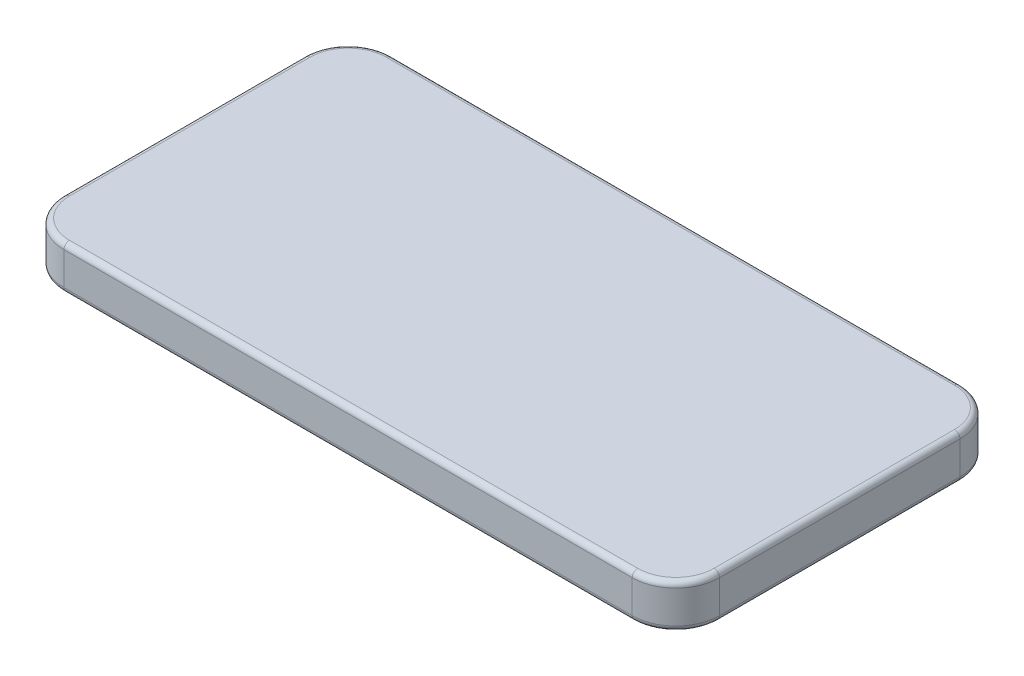
ISO-10303-21;
HEADER;
FILE_DESCRIPTION(('STEP AP214'),'2;1');
FILE_NAME('part.step','',(''),(''),'','','');
FILE_SCHEMA(('AUTOMOTIVE_DESIGN { 1 0 10303 214 1 1 1 1 }'));
ENDSEC;
DATA;
#1=APPLICATION_CONTEXT('core data for automotive mechanical design processes');
#2=APPLICATION_PROTOCOL_DEFINITION('international standard','automotive_design',2000,#1);
#3=PRODUCT_CONTEXT('',#1,'mechanical');
#4=PRODUCT('Part','Part','',(#3));
#5=PRODUCT_RELATED_PRODUCT_CATEGORY('part','',(#4));
#6=PRODUCT_DEFINITION_FORMATION('','',#4);
#7=PRODUCT_DEFINITION_CONTEXT('part definition',#1,'design');
#8=PRODUCT_DEFINITION('design','',#6,#7);
#9=PRODUCT_DEFINITION_SHAPE('','',#8);
#10=(LENGTH_UNIT() NAMED_UNIT(*) SI_UNIT(.MILLI.,.METRE.));
#11=(NAMED_UNIT(*) PLANE_ANGLE_UNIT() SI_UNIT($,.RADIAN.));
#12=(NAMED_UNIT(*) SI_UNIT($,.STERADIAN.) SOLID_ANGLE_UNIT());
#13=UNCERTAINTY_MEASURE_WITH_UNIT(LENGTH_MEASURE(1.E-05),#10,'distance_accuracy_value','');
#14=(GEOMETRIC_REPRESENTATION_CONTEXT(3) GLOBAL_UNCERTAINTY_ASSIGNED_CONTEXT((#13)) GLOBAL_UNIT_ASSIGNED_CONTEXT((#10,
#11,#12)) REPRESENTATION_CONTEXT('',''));
#15=CARTESIAN_POINT('',(0.,0.,0.));
#16=DIRECTION('',(0.,0.,1.));
#17=DIRECTION('',(1.,0.,0.));
#18=AXIS2_PLACEMENT_3D('',#15,#16,#17);
#19=CARTESIAN_POINT('',(50.8,50.8,-330.2));
#20=DIRECTION('',(0.,-1.,0.));
#21=DIRECTION('',(0.,0.,-1.));
#22=AXIS2_PLACEMENT_3D('',#19,#20,#21);
#23=CYLINDRICAL_SURFACE('',#22,50.8);
#24=DIRECTION('',(0.,-1.,0.));
#25=VECTOR('',#24,1.);
#26=CARTESIAN_POINT('',(50.8000000000004,50.8,-381.));
#27=LINE('',#26,#25);
#28=CARTESIAN_POINT('',(50.8000000000004,44.45,-381.));
#29=VERTEX_POINT('',#28);
#30=CARTESIAN_POINT('',(50.8000000000004,6.35,-381.));
#31=VERTEX_POINT('',#30);
#32=EDGE_CURVE('E214',#29,#31,#27,.T.);
#33=ORIENTED_EDGE('',*,*,#32,.T.);
#34=CARTESIAN_POINT('',(50.8,6.35,-330.2));
#35=DIRECTION('',(0.,-1.,0.));
#36=DIRECTION('',(0.,0.,-1.));
#37=AXIS2_PLACEMENT_3D('',#34,#35,#36);
#38=CIRCLE('',#37,50.8);
#39=CARTESIAN_POINT('',(0.,6.35,-330.2));
#40=VERTEX_POINT('',#39);
#41=EDGE_CURVE('E195',#31,#40,#38,.F.);
#42=ORIENTED_EDGE('',*,*,#41,.T.);
#43=DIRECTION('',(0.,-1.,0.));
#44=VECTOR('',#43,1.);
#45=CARTESIAN_POINT('',(0.,50.8,-330.2));
#46=LINE('',#45,#44);
#47=CARTESIAN_POINT('',(0.,44.45,-330.2));
#48=VERTEX_POINT('',#47);
#49=EDGE_CURVE('E170',#48,#40,#46,.T.);
#50=ORIENTED_EDGE('',*,*,#49,.F.);
#51=CARTESIAN_POINT('',(50.8,44.45,-330.2));
#52=DIRECTION('',(0.,-1.,0.));
#53=DIRECTION('',(0.,0.,-1.));
#54=AXIS2_PLACEMENT_3D('',#51,#52,#53);
#55=CIRCLE('',#54,50.8);
#56=EDGE_CURVE('E184',#48,#29,#55,.T.);
#57=ORIENTED_EDGE('',*,*,#56,.T.);
#58=EDGE_LOOP('',(#33,#42,#50,#57));
#59=FACE_BOUND('',#58,.T.);
#60=ADVANCED_FACE('F35',(#59),#23,.T.);
#61=CARTESIAN_POINT('',(0.,50.8,-50.8000000000004));
#62=DIRECTION('',(1.,0.,0.));
#63=DIRECTION('',(0.,0.,-1.));
#64=AXIS2_PLACEMENT_3D('',#61,#62,#63);
#65=PLANE('',#64);
#66=ORIENTED_EDGE('',*,*,#49,.T.);
#67=DIRECTION('',(0.,0.,1.));
#68=VECTOR('',#67,1.);
#69=CARTESIAN_POINT('',(0.,6.35,-50.8000000000004));
#70=LINE('',#69,#68);
#71=CARTESIAN_POINT('',(0.,6.35,-50.8000000000004));
#72=VERTEX_POINT('',#71);
#73=EDGE_CURVE('E11',#40,#72,#70,.T.);
#74=ORIENTED_EDGE('',*,*,#73,.T.);
#75=DIRECTION('',(0.,-1.,0.));
#76=VECTOR('',#75,1.);
#77=CARTESIAN_POINT('',(0.,50.8,-50.8000000000004));
#78=LINE('',#77,#76);
#79=CARTESIAN_POINT('',(0.,44.45,-50.8000000000004));
#80=VERTEX_POINT('',#79);
#81=EDGE_CURVE('E315',#80,#72,#78,.T.);
#82=ORIENTED_EDGE('',*,*,#81,.F.);
#83=DIRECTION('',(0.,0.,1.));
#84=VECTOR('',#83,1.);
#85=CARTESIAN_POINT('',(0.,44.45,-50.8000000000004));
#86=LINE('',#85,#84);
#87=EDGE_CURVE('E177',#80,#48,#86,.F.);
#88=ORIENTED_EDGE('',*,*,#87,.T.);
#89=EDGE_LOOP('',(#66,#74,#82,#88));
#90=FACE_BOUND('',#89,.T.);
#91=ADVANCED_FACE('F334',(#90),#65,.F.);
#92=CARTESIAN_POINT('',(50.8,50.8,-50.8));
#93=DIRECTION('',(0.,-1.,0.));
#94=DIRECTION('',(0.,0.,-1.));
#95=AXIS2_PLACEMENT_3D('',#92,#93,#94);
#96=CYLINDRICAL_SURFACE('',#95,50.8);
#97=ORIENTED_EDGE('',*,*,#81,.T.);
#98=CARTESIAN_POINT('',(50.8,6.35,-50.8));
#99=DIRECTION('',(0.,-1.,0.));
#100=DIRECTION('',(0.,0.,-1.));
#101=AXIS2_PLACEMENT_3D('',#98,#99,#100);
#102=CIRCLE('',#101,50.8);
#103=CARTESIAN_POINT('',(50.8000000000004,6.35,0.));
#104=VERTEX_POINT('',#103);
#105=EDGE_CURVE('E44',#72,#104,#102,.F.);
#106=ORIENTED_EDGE('',*,*,#105,.T.);
#107=DIRECTION('',(0.,-1.,0.));
#108=VECTOR('',#107,1.);
#109=CARTESIAN_POINT('',(50.8000000000004,50.8,0.));
#110=LINE('',#109,#108);
#111=CARTESIAN_POINT('',(50.8000000000004,44.45,0.));
#112=VERTEX_POINT('',#111);
#113=EDGE_CURVE('E313',#112,#104,#110,.T.);
#114=ORIENTED_EDGE('',*,*,#113,.F.);
#115=CARTESIAN_POINT('',(50.8,44.45,-50.8));
#116=DIRECTION('',(0.,-1.,0.));
#117=DIRECTION('',(0.,0.,-1.));
#118=AXIS2_PLACEMENT_3D('',#115,#116,#117);
#119=CIRCLE('',#118,50.8);
#120=EDGE_CURVE('E157',#112,#80,#119,.T.);
#121=ORIENTED_EDGE('',*,*,#120,.T.);
#122=EDGE_LOOP('',(#97,#106,#114,#121));
#123=FACE_BOUND('',#122,.T.);
#124=ADVANCED_FACE('F333',(#123),#96,.T.);
#125=CARTESIAN_POINT('',(50.8000000000004,50.8,0.));
#126=DIRECTION('',(0.,0.,-1.));
#127=DIRECTION('',(-1.,0.,0.));
#128=AXIS2_PLACEMENT_3D('',#125,#126,#127);
#129=PLANE('',#128);
#130=ORIENTED_EDGE('',*,*,#113,.T.);
#131=DIRECTION('',(1.,0.,0.));
#132=VECTOR('',#131,1.);
#133=CARTESIAN_POINT('',(711.2,6.35,0.));
#134=LINE('',#133,#132);
#135=CARTESIAN_POINT('',(711.2,6.35,0.));
#136=VERTEX_POINT('',#135);
#137=EDGE_CURVE('E242',#104,#136,#134,.T.);
#138=ORIENTED_EDGE('',*,*,#137,.T.);
#139=DIRECTION('',(0.,-1.,0.));
#140=VECTOR('',#139,1.);
#141=CARTESIAN_POINT('',(711.2,50.8,0.));
#142=LINE('',#141,#140);
#143=CARTESIAN_POINT('',(711.2,44.45,0.));
#144=VERTEX_POINT('',#143);
#145=EDGE_CURVE('E310',#144,#136,#142,.T.);
#146=ORIENTED_EDGE('',*,*,#145,.F.);
#147=DIRECTION('',(1.,0.,0.));
#148=VECTOR('',#147,1.);
#149=CARTESIAN_POINT('',(50.8000000000004,44.45,0.));
#150=LINE('',#149,#148);
#151=EDGE_CURVE('E194',#144,#112,#150,.F.);
#152=ORIENTED_EDGE('',*,*,#151,.T.);
#153=EDGE_LOOP('',(#130,#138,#146,#152));
#154=FACE_BOUND('',#153,.T.);
#155=ADVANCED_FACE('F341',(#154),#129,.F.);
#156=CARTESIAN_POINT('',(711.2,50.8,-50.8));
#157=DIRECTION('',(0.,-1.,0.));
#158=DIRECTION('',(0.,0.,-1.));
#159=AXIS2_PLACEMENT_3D('',#156,#157,#158);
#160=CYLINDRICAL_SURFACE('',#159,50.8);
#161=ORIENTED_EDGE('',*,*,#145,.T.);
#162=CARTESIAN_POINT('',(711.2,6.35,-50.8));
#163=DIRECTION('',(0.,-1.,0.));
#164=DIRECTION('',(0.,0.,-1.));
#165=AXIS2_PLACEMENT_3D('',#162,#163,#164);
#166=CIRCLE('',#165,50.8);
#167=CARTESIAN_POINT('',(762.,6.35,-50.8000000000004));
#168=VERTEX_POINT('',#167);
#169=EDGE_CURVE('E240',#136,#168,#166,.F.);
#170=ORIENTED_EDGE('',*,*,#169,.T.);
#171=DIRECTION('',(0.,-1.,0.));
#172=VECTOR('',#171,1.);
#173=CARTESIAN_POINT('',(762.,50.8,-50.8000000000004));
#174=LINE('',#173,#172);
#175=CARTESIAN_POINT('',(762.,44.45,-50.8000000000004));
#176=VERTEX_POINT('',#175);
#177=EDGE_CURVE('E307',#176,#168,#174,.T.);
#178=ORIENTED_EDGE('',*,*,#177,.F.);
#179=CARTESIAN_POINT('',(711.2,44.45,-50.8));
#180=DIRECTION('',(0.,-1.,0.));
#181=DIRECTION('',(0.,0.,-1.));
#182=AXIS2_PLACEMENT_3D('',#179,#180,#181);
#183=CIRCLE('',#182,50.8);
#184=EDGE_CURVE('E192',#176,#144,#183,.T.);
#185=ORIENTED_EDGE('',*,*,#184,.T.);
#186=EDGE_LOOP('',(#161,#170,#178,#185));
#187=FACE_BOUND('',#186,.T.);
#188=ADVANCED_FACE('F460',(#187),#160,.T.);
#189=CARTESIAN_POINT('',(762.,50.8,-50.8000000000004));
#190=DIRECTION('',(-1.,0.,0.));
#191=DIRECTION('',(0.,0.,1.));
#192=AXIS2_PLACEMENT_3D('',#189,#190,#191);
#193=PLANE('',#192);
#194=ORIENTED_EDGE('',*,*,#177,.T.);
#195=DIRECTION('',(0.,0.,-1.));
#196=VECTOR('',#195,1.);
#197=CARTESIAN_POINT('',(762.,6.35,-330.2));
#198=LINE('',#197,#196);
#199=CARTESIAN_POINT('',(762.,6.35,-330.2));
#200=VERTEX_POINT('',#199);
#201=EDGE_CURVE('E238',#168,#200,#198,.T.);
#202=ORIENTED_EDGE('',*,*,#201,.T.);
#203=DIRECTION('',(0.,-1.,0.));
#204=VECTOR('',#203,1.);
#205=CARTESIAN_POINT('',(762.,50.8,-330.2));
#206=LINE('',#205,#204);
#207=CARTESIAN_POINT('',(762.,44.45,-330.2));
#208=VERTEX_POINT('',#207);
#209=EDGE_CURVE('E302',#208,#200,#206,.T.);
#210=ORIENTED_EDGE('',*,*,#209,.F.);
#211=DIRECTION('',(0.,0.,-1.));
#212=VECTOR('',#211,1.);
#213=CARTESIAN_POINT('',(762.,44.45,-50.8000000000004));
#214=LINE('',#213,#212);
#215=EDGE_CURVE('E190',#208,#176,#214,.F.);
#216=ORIENTED_EDGE('',*,*,#215,.T.);
#217=EDGE_LOOP('',(#194,#202,#210,#216));
#218=FACE_BOUND('',#217,.T.);
#219=ADVANCED_FACE('F452',(#218),#193,.F.);
#220=CARTESIAN_POINT('',(711.2,50.8,-330.2));
#221=DIRECTION('',(0.,-1.,0.));
#222=DIRECTION('',(0.,0.,-1.));
#223=AXIS2_PLACEMENT_3D('',#220,#221,#222);
#224=CYLINDRICAL_SURFACE('',#223,50.8);
#225=ORIENTED_EDGE('',*,*,#209,.T.);
#226=CARTESIAN_POINT('',(711.2,6.35,-330.2));
#227=DIRECTION('',(0.,-1.,0.));
#228=DIRECTION('',(0.,0.,-1.));
#229=AXIS2_PLACEMENT_3D('',#226,#227,#228);
#230=CIRCLE('',#229,50.8);
#231=CARTESIAN_POINT('',(711.2,6.35,-381.));
#232=VERTEX_POINT('',#231);
#233=EDGE_CURVE('E236',#200,#232,#230,.F.);
#234=ORIENTED_EDGE('',*,*,#233,.T.);
#235=DIRECTION('',(0.,-1.,0.));
#236=VECTOR('',#235,1.);
#237=CARTESIAN_POINT('',(711.2,50.8,-381.));
#238=LINE('',#237,#236);
#239=CARTESIAN_POINT('',(711.2,44.45,-381.));
#240=VERTEX_POINT('',#239);
#241=EDGE_CURVE('E297',#240,#232,#238,.T.);
#242=ORIENTED_EDGE('',*,*,#241,.F.);
#243=CARTESIAN_POINT('',(711.2,44.45,-330.2));
#244=DIRECTION('',(0.,-1.,0.));
#245=DIRECTION('',(0.,0.,-1.));
#246=AXIS2_PLACEMENT_3D('',#243,#244,#245);
#247=CIRCLE('',#246,50.8);
#248=EDGE_CURVE('E188',#240,#208,#247,.T.);
#249=ORIENTED_EDGE('',*,*,#248,.T.);
#250=EDGE_LOOP('',(#225,#234,#242,#249));
#251=FACE_BOUND('',#250,.T.);
#252=ADVANCED_FACE('F445',(#251),#224,.T.);
#253=CARTESIAN_POINT('',(50.8000000000004,50.8,-381.));
#254=DIRECTION('',(0.,0.,1.));
#255=DIRECTION('',(1.,0.,0.));
#256=AXIS2_PLACEMENT_3D('',#253,#254,#255);
#257=PLANE('',#256);
#258=ORIENTED_EDGE('',*,*,#241,.T.);
#259=DIRECTION('',(-1.,0.,0.));
#260=VECTOR('',#259,1.);
#261=CARTESIAN_POINT('',(50.8000000000004,6.35,-381.));
#262=LINE('',#261,#260);
#263=EDGE_CURVE('E234',#232,#31,#262,.T.);
#264=ORIENTED_EDGE('',*,*,#263,.T.);
#265=ORIENTED_EDGE('',*,*,#32,.F.);
#266=DIRECTION('',(-1.,0.,0.));
#267=VECTOR('',#266,1.);
#268=CARTESIAN_POINT('',(50.8000000000004,44.45,-381.));
#269=LINE('',#268,#267);
#270=EDGE_CURVE('E186',#29,#240,#269,.F.);
#271=ORIENTED_EDGE('',*,*,#270,.T.);
#272=EDGE_LOOP('',(#258,#264,#265,#271));
#273=FACE_BOUND('',#272,.T.);
#274=ADVANCED_FACE('F294',(#273),#257,.F.);
#275=CARTESIAN_POINT('',(50.8,50.8,-330.2));
#276=DIRECTION('',(0.,-1.,0.));
#277=DIRECTION('',(0.,0.,-1.));
#278=AXIS2_PLACEMENT_3D('',#275,#276,#277);
#279=PLANE('',#278);
#280=DIRECTION('',(0.,0.,1.));
#281=VECTOR('',#280,1.);
#282=CARTESIAN_POINT('',(6.35,50.8,-330.2));
#283=LINE('',#282,#281);
#284=CARTESIAN_POINT('',(6.34999999999999,50.8,-330.2));
#285=VERTEX_POINT('',#284);
#286=CARTESIAN_POINT('',(6.35,50.8,-50.8000000000003));
#287=VERTEX_POINT('',#286);
#288=EDGE_CURVE('E174',#285,#287,#283,.T.);
#289=ORIENTED_EDGE('',*,*,#288,.T.);
#290=CARTESIAN_POINT('',(50.8,50.8,-50.8));
#291=DIRECTION('',(0.,-1.,0.));
#292=DIRECTION('',(0.,0.,-1.));
#293=AXIS2_PLACEMENT_3D('',#290,#291,#292);
#294=CIRCLE('',#293,44.45);
#295=CARTESIAN_POINT('',(50.8000000000003,50.8,-6.35000000000002));
#296=VERTEX_POINT('',#295);
#297=EDGE_CURVE('E155',#287,#296,#294,.F.);
#298=ORIENTED_EDGE('',*,*,#297,.T.);
#299=DIRECTION('',(1.,0.,0.));
#300=VECTOR('',#299,1.);
#301=CARTESIAN_POINT('',(50.8,50.8,-6.35000000000002));
#302=LINE('',#301,#300);
#303=CARTESIAN_POINT('',(711.2,50.8,-6.35000000000002));
#304=VERTEX_POINT('',#303);
#305=EDGE_CURVE('E163',#296,#304,#302,.T.);
#306=ORIENTED_EDGE('',*,*,#305,.T.);
#307=CARTESIAN_POINT('',(711.2,50.8,-50.8));
#308=DIRECTION('',(0.,-1.,0.));
#309=DIRECTION('',(0.,0.,-1.));
#310=AXIS2_PLACEMENT_3D('',#307,#308,#309);
#311=CIRCLE('',#310,44.45);
#312=CARTESIAN_POINT('',(755.65,50.8,-50.8000000000004));
#313=VERTEX_POINT('',#312);
#314=EDGE_CURVE('E169',#304,#313,#311,.F.);
#315=ORIENTED_EDGE('',*,*,#314,.T.);
#316=DIRECTION('',(0.,0.,-1.));
#317=VECTOR('',#316,1.);
#318=CARTESIAN_POINT('',(755.65,50.8,-330.2));
#319=LINE('',#318,#317);
#320=CARTESIAN_POINT('',(755.65,50.8,-330.2));
#321=VERTEX_POINT('',#320);
#322=EDGE_CURVE('E319',#313,#321,#319,.T.);
#323=ORIENTED_EDGE('',*,*,#322,.T.);
#324=CARTESIAN_POINT('',(711.2,50.8,-330.2));
#325=DIRECTION('',(0.,-1.,0.));
#326=DIRECTION('',(0.,0.,-1.));
#327=AXIS2_PLACEMENT_3D('',#324,#325,#326);
#328=CIRCLE('',#327,44.45);
#329=CARTESIAN_POINT('',(711.2,50.8,-374.65));
#330=VERTEX_POINT('',#329);
#331=EDGE_CURVE('E321',#321,#330,#328,.F.);
#332=ORIENTED_EDGE('',*,*,#331,.T.);
#333=DIRECTION('',(-1.,0.,0.));
#334=VECTOR('',#333,1.);
#335=CARTESIAN_POINT('',(50.8,50.8,-374.65));
#336=LINE('',#335,#334);
#337=CARTESIAN_POINT('',(50.8000000000003,50.8,-374.65));
#338=VERTEX_POINT('',#337);
#339=EDGE_CURVE('E323',#330,#338,#336,.T.);
#340=ORIENTED_EDGE('',*,*,#339,.T.);
#341=CARTESIAN_POINT('',(50.8,50.8,-330.2));
#342=DIRECTION('',(0.,-1.,0.));
#343=DIRECTION('',(0.,0.,-1.));
#344=AXIS2_PLACEMENT_3D('',#341,#342,#343);
#345=CIRCLE('',#344,44.45);
#346=EDGE_CURVE('E179',#338,#285,#345,.F.);
#347=ORIENTED_EDGE('',*,*,#346,.T.);
#348=EDGE_LOOP('',(#289,#298,#306,#315,#323,#332,#340,#347));
#349=FACE_BOUND('',#348,.T.);
#350=ADVANCED_FACE('F172',(#349),#279,.F.);
#351=CARTESIAN_POINT('',(50.8,0.,-330.2));
#352=DIRECTION('',(0.,-1.,0.));
#353=DIRECTION('',(0.,0.,-1.));
#354=AXIS2_PLACEMENT_3D('',#351,#352,#353);
#355=PLANE('',#354);
#356=DIRECTION('',(0.,0.,1.));
#357=VECTOR('',#356,1.);
#358=CARTESIAN_POINT('',(6.35,0.,-330.2));
#359=LINE('',#358,#357);
#360=CARTESIAN_POINT('',(6.35,0.,-50.8000000000003));
#361=VERTEX_POINT('',#360);
#362=CARTESIAN_POINT('',(6.35,0.,-330.2));
#363=VERTEX_POINT('',#362);
#364=EDGE_CURVE('E217',#361,#363,#359,.F.);
#365=ORIENTED_EDGE('',*,*,#364,.T.);
#366=CARTESIAN_POINT('',(50.8,0.,-330.2));
#367=DIRECTION('',(0.,-1.,0.));
#368=DIRECTION('',(0.,0.,-1.));
#369=AXIS2_PLACEMENT_3D('',#366,#367,#368);
#370=CIRCLE('',#369,44.45);
#371=CARTESIAN_POINT('',(50.8000000000003,0.,-374.65));
#372=VERTEX_POINT('',#371);
#373=EDGE_CURVE('E231',#363,#372,#370,.T.);
#374=ORIENTED_EDGE('',*,*,#373,.T.);
#375=DIRECTION('',(-1.,0.,0.));
#376=VECTOR('',#375,1.);
#377=CARTESIAN_POINT('',(711.2,0.,-374.65));
#378=LINE('',#377,#376);
#379=CARTESIAN_POINT('',(711.2,0.,-374.65));
#380=VERTEX_POINT('',#379);
#381=EDGE_CURVE('E229',#372,#380,#378,.F.);
#382=ORIENTED_EDGE('',*,*,#381,.T.);
#383=CARTESIAN_POINT('',(711.2,0.,-330.2));
#384=DIRECTION('',(0.,-1.,0.));
#385=DIRECTION('',(0.,0.,-1.));
#386=AXIS2_PLACEMENT_3D('',#383,#384,#385);
#387=CIRCLE('',#386,44.45);
#388=CARTESIAN_POINT('',(755.65,0.,-330.2));
#389=VERTEX_POINT('',#388);
#390=EDGE_CURVE('E227',#380,#389,#387,.T.);
#391=ORIENTED_EDGE('',*,*,#390,.T.);
#392=DIRECTION('',(0.,0.,-1.));
#393=VECTOR('',#392,1.);
#394=CARTESIAN_POINT('',(755.65,0.,-50.8000000000004));
#395=LINE('',#394,#393);
#396=CARTESIAN_POINT('',(755.65,0.,-50.8000000000004));
#397=VERTEX_POINT('',#396);
#398=EDGE_CURVE('E225',#389,#397,#395,.F.);
#399=ORIENTED_EDGE('',*,*,#398,.T.);
#400=CARTESIAN_POINT('',(711.2,0.,-50.8));
#401=DIRECTION('',(0.,-1.,0.));
#402=DIRECTION('',(0.,0.,-1.));
#403=AXIS2_PLACEMENT_3D('',#400,#401,#402);
#404=CIRCLE('',#403,44.45);
#405=CARTESIAN_POINT('',(711.2,0.,-6.35));
#406=VERTEX_POINT('',#405);
#407=EDGE_CURVE('E223',#397,#406,#404,.T.);
#408=ORIENTED_EDGE('',*,*,#407,.T.);
#409=DIRECTION('',(1.,0.,0.));
#410=VECTOR('',#409,1.);
#411=CARTESIAN_POINT('',(50.8000000000004,0.,-6.35));
#412=LINE('',#411,#410);
#413=CARTESIAN_POINT('',(50.8000000000004,0.,-6.35));
#414=VERTEX_POINT('',#413);
#415=EDGE_CURVE('E221',#406,#414,#412,.F.);
#416=ORIENTED_EDGE('',*,*,#415,.T.);
#417=CARTESIAN_POINT('',(50.8,0.,-50.8));
#418=DIRECTION('',(0.,-1.,0.));
#419=DIRECTION('',(0.,0.,-1.));
#420=AXIS2_PLACEMENT_3D('',#417,#418,#419);
#421=CIRCLE('',#420,44.45);
#422=EDGE_CURVE('E219',#414,#361,#421,.T.);
#423=ORIENTED_EDGE('',*,*,#422,.T.);
#424=EDGE_LOOP('',(#365,#374,#382,#391,#399,#408,#416,#423));
#425=FACE_BOUND('',#424,.T.);
#426=ADVANCED_FACE('F277',(#425),#355,.T.);
#427=CARTESIAN_POINT('',(711.2,44.45,-330.2));
#428=DIRECTION('',(0.,-1.,0.));
#429=DIRECTION('',(0.,0.,-1.));
#430=AXIS2_PLACEMENT_3D('',#427,#428,#429);
#431=TOROIDAL_SURFACE('',#430,44.45,6.35);
#432=CARTESIAN_POINT('',(755.65,44.45,-330.2));
#433=DIRECTION('',(0.,0.,1.));
#434=DIRECTION('',(1.,0.,0.));
#435=AXIS2_PLACEMENT_3D('',#432,#433,#434);
#436=CIRCLE('',#435,6.35);
#437=EDGE_CURVE('E208',#208,#321,#436,.T.);
#438=ORIENTED_EDGE('',*,*,#437,.F.);
#439=ORIENTED_EDGE('',*,*,#248,.F.);
#440=CARTESIAN_POINT('',(711.2,44.45,-374.65));
#441=DIRECTION('',(-1.,0.,0.));
#442=DIRECTION('',(0.,0.,1.));
#443=AXIS2_PLACEMENT_3D('',#440,#441,#442);
#444=CIRCLE('',#443,6.35);
#445=EDGE_CURVE('E211',#330,#240,#444,.T.);
#446=ORIENTED_EDGE('',*,*,#445,.F.);
#447=ORIENTED_EDGE('',*,*,#331,.F.);
#448=EDGE_LOOP('',(#438,#439,#446,#447));
#449=FACE_BOUND('',#448,.T.);
#450=ADVANCED_FACE('F365',(#449),#431,.T.);
#451=CARTESIAN_POINT('',(50.8,44.45,-374.65));
#452=DIRECTION('',(-1.,0.,0.));
#453=DIRECTION('',(0.,0.,1.));
#454=AXIS2_PLACEMENT_3D('',#451,#452,#453);
#455=CYLINDRICAL_SURFACE('',#454,6.35);
#456=ORIENTED_EDGE('',*,*,#445,.T.);
#457=ORIENTED_EDGE('',*,*,#270,.F.);
#458=CARTESIAN_POINT('',(50.8000000000003,44.45,-374.65));
#459=DIRECTION('',(-1.,0.,0.));
#460=DIRECTION('',(0.,0.,1.));
#461=AXIS2_PLACEMENT_3D('',#458,#459,#460);
#462=CIRCLE('',#461,6.35);
#463=EDGE_CURVE('E205',#338,#29,#462,.T.);
#464=ORIENTED_EDGE('',*,*,#463,.F.);
#465=ORIENTED_EDGE('',*,*,#339,.F.);
#466=EDGE_LOOP('',(#456,#457,#464,#465));
#467=FACE_BOUND('',#466,.T.);
#468=ADVANCED_FACE('F361',(#467),#455,.T.);
#469=CARTESIAN_POINT('',(755.65,44.45,-330.2));
#470=DIRECTION('',(0.,0.,-1.));
#471=DIRECTION('',(-1.,0.,0.));
#472=AXIS2_PLACEMENT_3D('',#469,#470,#471);
#473=CYLINDRICAL_SURFACE('',#472,6.35);
#474=ORIENTED_EDGE('',*,*,#437,.T.);
#475=ORIENTED_EDGE('',*,*,#322,.F.);
#476=CARTESIAN_POINT('',(755.65,44.45,-50.8000000000004));
#477=DIRECTION('',(0.,0.,1.));
#478=DIRECTION('',(1.,0.,0.));
#479=AXIS2_PLACEMENT_3D('',#476,#477,#478);
#480=CIRCLE('',#479,6.35);
#481=EDGE_CURVE('E202',#176,#313,#480,.T.);
#482=ORIENTED_EDGE('',*,*,#481,.F.);
#483=ORIENTED_EDGE('',*,*,#215,.F.);
#484=EDGE_LOOP('',(#474,#475,#482,#483));
#485=FACE_BOUND('',#484,.T.);
#486=ADVANCED_FACE('F358',(#485),#473,.T.);
#487=CARTESIAN_POINT('',(50.8,44.45,-330.2));
#488=DIRECTION('',(0.,-1.,0.));
#489=DIRECTION('',(0.,0.,-1.));
#490=AXIS2_PLACEMENT_3D('',#487,#488,#489);
#491=TOROIDAL_SURFACE('',#490,44.45,6.35);
#492=ORIENTED_EDGE('',*,*,#463,.T.);
#493=ORIENTED_EDGE('',*,*,#56,.F.);
#494=CARTESIAN_POINT('',(6.34999999999999,44.45,-330.2));
#495=DIRECTION('',(0.,0.,1.));
#496=DIRECTION('',(1.,0.,0.));
#497=AXIS2_PLACEMENT_3D('',#494,#495,#496);
#498=CIRCLE('',#497,6.35);
#499=EDGE_CURVE('E199',#285,#48,#498,.T.);
#500=ORIENTED_EDGE('',*,*,#499,.F.);
#501=ORIENTED_EDGE('',*,*,#346,.F.);
#502=EDGE_LOOP('',(#492,#493,#500,#501));
#503=FACE_BOUND('',#502,.T.);
#504=ADVANCED_FACE('F329',(#503),#491,.T.);
#505=CARTESIAN_POINT('',(711.2,44.45,-50.8));
#506=DIRECTION('',(0.,-1.,0.));
#507=DIRECTION('',(0.,0.,-1.));
#508=AXIS2_PLACEMENT_3D('',#505,#506,#507);
#509=TOROIDAL_SURFACE('',#508,44.45,6.35);
#510=ORIENTED_EDGE('',*,*,#481,.T.);
#511=ORIENTED_EDGE('',*,*,#314,.F.);
#512=CARTESIAN_POINT('',(711.2,44.45,-6.35000000000002));
#513=DIRECTION('',(-1.,0.,0.));
#514=DIRECTION('',(0.,0.,1.));
#515=AXIS2_PLACEMENT_3D('',#512,#513,#514);
#516=CIRCLE('',#515,6.35);
#517=EDGE_CURVE('E166',#144,#304,#516,.T.);
#518=ORIENTED_EDGE('',*,*,#517,.F.);
#519=ORIENTED_EDGE('',*,*,#184,.F.);
#520=EDGE_LOOP('',(#510,#511,#518,#519));
#521=FACE_BOUND('',#520,.T.);
#522=ADVANCED_FACE('F352',(#521),#509,.T.);
#523=CARTESIAN_POINT('',(6.35,44.45,-330.2));
#524=DIRECTION('',(0.,0.,1.));
#525=DIRECTION('',(1.,0.,0.));
#526=AXIS2_PLACEMENT_3D('',#523,#524,#525);
#527=CYLINDRICAL_SURFACE('',#526,6.35);
#528=ORIENTED_EDGE('',*,*,#499,.T.);
#529=ORIENTED_EDGE('',*,*,#87,.F.);
#530=CARTESIAN_POINT('',(6.35,44.45,-50.8000000000003));
#531=DIRECTION('',(0.,0.,1.));
#532=DIRECTION('',(1.,0.,0.));
#533=AXIS2_PLACEMENT_3D('',#530,#531,#532);
#534=CIRCLE('',#533,6.35);
#535=EDGE_CURVE('E160',#287,#80,#534,.T.);
#536=ORIENTED_EDGE('',*,*,#535,.F.);
#537=ORIENTED_EDGE('',*,*,#288,.F.);
#538=EDGE_LOOP('',(#528,#529,#536,#537));
#539=FACE_BOUND('',#538,.T.);
#540=ADVANCED_FACE('F332',(#539),#527,.T.);
#541=CARTESIAN_POINT('',(50.8,44.45,-6.35000000000002));
#542=DIRECTION('',(1.,0.,0.));
#543=DIRECTION('',(0.,0.,-1.));
#544=AXIS2_PLACEMENT_3D('',#541,#542,#543);
#545=CYLINDRICAL_SURFACE('',#544,6.35);
#546=ORIENTED_EDGE('',*,*,#517,.T.);
#547=ORIENTED_EDGE('',*,*,#305,.F.);
#548=CARTESIAN_POINT('',(50.8000000000004,44.45,-6.35));
#549=DIRECTION('',(-1.,0.,0.));
#550=DIRECTION('',(0.,-1.,0.));
#551=AXIS2_PLACEMENT_3D('',#548,#549,#550);
#552=CIRCLE('',#551,6.35);
#553=EDGE_CURVE('E151',#112,#296,#552,.T.);
#554=ORIENTED_EDGE('',*,*,#553,.F.);
#555=ORIENTED_EDGE('',*,*,#151,.F.);
#556=EDGE_LOOP('',(#546,#547,#554,#555));
#557=FACE_BOUND('',#556,.T.);
#558=ADVANCED_FACE('F164',(#557),#545,.T.);
#559=CARTESIAN_POINT('',(50.8,44.45,-50.8));
#560=DIRECTION('',(0.,-1.,0.));
#561=DIRECTION('',(0.,0.,-1.));
#562=AXIS2_PLACEMENT_3D('',#559,#560,#561);
#563=TOROIDAL_SURFACE('',#562,44.45,6.35);
#564=ORIENTED_EDGE('',*,*,#535,.T.);
#565=ORIENTED_EDGE('',*,*,#120,.F.);
#566=ORIENTED_EDGE('',*,*,#553,.T.);
#567=ORIENTED_EDGE('',*,*,#297,.F.);
#568=EDGE_LOOP('',(#564,#565,#566,#567));
#569=FACE_BOUND('',#568,.T.);
#570=ADVANCED_FACE('F153',(#569),#563,.T.);
#571=CARTESIAN_POINT('',(711.2,6.35,-50.8));
#572=DIRECTION('',(0.,-1.,0.));
#573=DIRECTION('',(0.,0.,-1.));
#574=AXIS2_PLACEMENT_3D('',#571,#572,#573);
#575=TOROIDAL_SURFACE('',#574,44.45,6.35);
#576=CARTESIAN_POINT('',(711.2,6.35,-6.35000000000002));
#577=DIRECTION('',(-1.,0.,0.));
#578=DIRECTION('',(0.,0.,1.));
#579=AXIS2_PLACEMENT_3D('',#576,#577,#578);
#580=CIRCLE('',#579,6.35);
#581=EDGE_CURVE('E260',#406,#136,#580,.T.);
#582=ORIENTED_EDGE('',*,*,#581,.F.);
#583=ORIENTED_EDGE('',*,*,#407,.F.);
#584=CARTESIAN_POINT('',(755.65,6.35,-50.8000000000003));
#585=DIRECTION('',(0.,0.,-1.));
#586=DIRECTION('',(-1.,0.,0.));
#587=AXIS2_PLACEMENT_3D('',#584,#585,#586);
#588=CIRCLE('',#587,6.35);
#589=EDGE_CURVE('E39',#168,#397,#588,.T.);
#590=ORIENTED_EDGE('',*,*,#589,.F.);
#591=ORIENTED_EDGE('',*,*,#169,.F.);
#592=EDGE_LOOP('',(#582,#583,#590,#591));
#593=FACE_BOUND('',#592,.T.);
#594=ADVANCED_FACE('F37',(#593),#575,.T.);
#595=CARTESIAN_POINT('',(755.65,6.35,-50.8000000000004));
#596=DIRECTION('',(0.,0.,1.));
#597=DIRECTION('',(1.,0.,0.));
#598=AXIS2_PLACEMENT_3D('',#595,#596,#597);
#599=CYLINDRICAL_SURFACE('',#598,6.35);
#600=ORIENTED_EDGE('',*,*,#589,.T.);
#601=ORIENTED_EDGE('',*,*,#398,.F.);
#602=CARTESIAN_POINT('',(755.65,6.35,-330.2));
#603=DIRECTION('',(0.,0.,-1.));
#604=DIRECTION('',(0.,1.,0.));
#605=AXIS2_PLACEMENT_3D('',#602,#603,#604);
#606=CIRCLE('',#605,6.35);
#607=EDGE_CURVE('E258',#200,#389,#606,.T.);
#608=ORIENTED_EDGE('',*,*,#607,.F.);
#609=ORIENTED_EDGE('',*,*,#201,.F.);
#610=EDGE_LOOP('',(#600,#601,#608,#609));
#611=FACE_BOUND('',#610,.T.);
#612=ADVANCED_FACE('F271',(#611),#599,.T.);
#613=CARTESIAN_POINT('',(50.8000000000004,6.35,-6.35));
#614=DIRECTION('',(-1.,0.,0.));
#615=DIRECTION('',(0.,0.,1.));
#616=AXIS2_PLACEMENT_3D('',#613,#614,#615);
#617=CYLINDRICAL_SURFACE('',#616,6.35);
#618=ORIENTED_EDGE('',*,*,#581,.T.);
#619=ORIENTED_EDGE('',*,*,#137,.F.);
#620=CARTESIAN_POINT('',(50.8000000000004,6.35,-6.35));
#621=DIRECTION('',(-1.,0.,0.));
#622=DIRECTION('',(0.,0.,1.));
#623=AXIS2_PLACEMENT_3D('',#620,#621,#622);
#624=CIRCLE('',#623,6.35);
#625=EDGE_CURVE('E255',#414,#104,#624,.T.);
#626=ORIENTED_EDGE('',*,*,#625,.F.);
#627=ORIENTED_EDGE('',*,*,#415,.F.);
#628=EDGE_LOOP('',(#618,#619,#626,#627));
#629=FACE_BOUND('',#628,.T.);
#630=ADVANCED_FACE('F386',(#629),#617,.T.);
#631=CARTESIAN_POINT('',(711.2,6.35,-330.2));
#632=DIRECTION('',(0.,-1.,0.));
#633=DIRECTION('',(0.,0.,-1.));
#634=AXIS2_PLACEMENT_3D('',#631,#632,#633);
#635=TOROIDAL_SURFACE('',#634,44.45,6.35);
#636=ORIENTED_EDGE('',*,*,#607,.T.);
#637=ORIENTED_EDGE('',*,*,#390,.F.);
#638=CARTESIAN_POINT('',(711.2,6.35,-374.65));
#639=DIRECTION('',(-1.,0.,0.));
#640=DIRECTION('',(0.,0.,1.));
#641=AXIS2_PLACEMENT_3D('',#638,#639,#640);
#642=CIRCLE('',#641,6.35);
#643=EDGE_CURVE('E252',#232,#380,#642,.T.);
#644=ORIENTED_EDGE('',*,*,#643,.F.);
#645=ORIENTED_EDGE('',*,*,#233,.F.);
#646=EDGE_LOOP('',(#636,#637,#644,#645));
#647=FACE_BOUND('',#646,.T.);
#648=ADVANCED_FACE('F283',(#647),#635,.T.);
#649=CARTESIAN_POINT('',(50.8,6.35,-50.8));
#650=DIRECTION('',(0.,-1.,0.));
#651=DIRECTION('',(0.,0.,-1.));
#652=AXIS2_PLACEMENT_3D('',#649,#650,#651);
#653=TOROIDAL_SURFACE('',#652,44.45,6.35);
#654=ORIENTED_EDGE('',*,*,#625,.T.);
#655=ORIENTED_EDGE('',*,*,#105,.F.);
#656=CARTESIAN_POINT('',(6.35,6.35,-50.8000000000003));
#657=DIRECTION('',(0.,0.,-1.));
#658=DIRECTION('',(-1.,0.,0.));
#659=AXIS2_PLACEMENT_3D('',#656,#657,#658);
#660=CIRCLE('',#659,6.35);
#661=EDGE_CURVE('E249',#361,#72,#660,.T.);
#662=ORIENTED_EDGE('',*,*,#661,.F.);
#663=ORIENTED_EDGE('',*,*,#422,.F.);
#664=EDGE_LOOP('',(#654,#655,#662,#663));
#665=FACE_BOUND('',#664,.T.);
#666=ADVANCED_FACE('F380',(#665),#653,.T.);
#667=CARTESIAN_POINT('',(50.8000000000004,6.35,-374.65));
#668=DIRECTION('',(1.,0.,0.));
#669=DIRECTION('',(0.,0.,-1.));
#670=AXIS2_PLACEMENT_3D('',#667,#668,#669);
#671=CYLINDRICAL_SURFACE('',#670,6.35);
#672=ORIENTED_EDGE('',*,*,#643,.T.);
#673=ORIENTED_EDGE('',*,*,#381,.F.);
#674=CARTESIAN_POINT('',(50.8000000000004,6.35,-374.65));
#675=DIRECTION('',(-1.,0.,0.));
#676=DIRECTION('',(0.,-1.,0.));
#677=AXIS2_PLACEMENT_3D('',#674,#675,#676);
#678=CIRCLE('',#677,6.35);
#679=EDGE_CURVE('E247',#31,#372,#678,.T.);
#680=ORIENTED_EDGE('',*,*,#679,.F.);
#681=ORIENTED_EDGE('',*,*,#263,.F.);
#682=EDGE_LOOP('',(#672,#673,#680,#681));
#683=FACE_BOUND('',#682,.T.);
#684=ADVANCED_FACE('F287',(#683),#671,.T.);
#685=CARTESIAN_POINT('',(6.35,6.35,-50.8000000000004));
#686=DIRECTION('',(0.,0.,-1.));
#687=DIRECTION('',(-1.,0.,0.));
#688=AXIS2_PLACEMENT_3D('',#685,#686,#687);
#689=CYLINDRICAL_SURFACE('',#688,6.35);
#690=ORIENTED_EDGE('',*,*,#661,.T.);
#691=ORIENTED_EDGE('',*,*,#73,.F.);
#692=CARTESIAN_POINT('',(6.35,6.35,-330.2));
#693=DIRECTION('',(0.,0.,-1.));
#694=DIRECTION('',(-1.,0.,0.));
#695=AXIS2_PLACEMENT_3D('',#692,#693,#694);
#696=CIRCLE('',#695,6.35);
#697=EDGE_CURVE('E245',#363,#40,#696,.T.);
#698=ORIENTED_EDGE('',*,*,#697,.F.);
#699=ORIENTED_EDGE('',*,*,#364,.F.);
#700=EDGE_LOOP('',(#690,#691,#698,#699));
#701=FACE_BOUND('',#700,.T.);
#702=ADVANCED_FACE('F373',(#701),#689,.T.);
#703=CARTESIAN_POINT('',(50.8,6.35,-330.2));
#704=DIRECTION('',(0.,-1.,0.));
#705=DIRECTION('',(0.,0.,-1.));
#706=AXIS2_PLACEMENT_3D('',#703,#704,#705);
#707=TOROIDAL_SURFACE('',#706,44.45,6.35);
#708=ORIENTED_EDGE('',*,*,#679,.T.);
#709=ORIENTED_EDGE('',*,*,#373,.F.);
#710=ORIENTED_EDGE('',*,*,#697,.T.);
#711=ORIENTED_EDGE('',*,*,#41,.F.);
#712=EDGE_LOOP('',(#708,#709,#710,#711));
#713=FACE_BOUND('',#712,.T.);
#714=ADVANCED_FACE('F370',(#713),#707,.T.);
#715=CLOSED_SHELL('',(#60,#91,#124,#155,#188,#219,#252,#274,#350,#426,#450,#468,#486,#504,#522,
#540,#558,#570,#594,#612,#630,#648,#666,#684,#702,#714));
#716=MANIFOLD_SOLID_BREP('B2',#715);
#717=ADVANCED_BREP_SHAPE_REPRESENTATION('',(#18,#716),#14);
#718=SHAPE_DEFINITION_REPRESENTATION(#9,#717);
ENDSEC;
END-ISO-10303-21;
